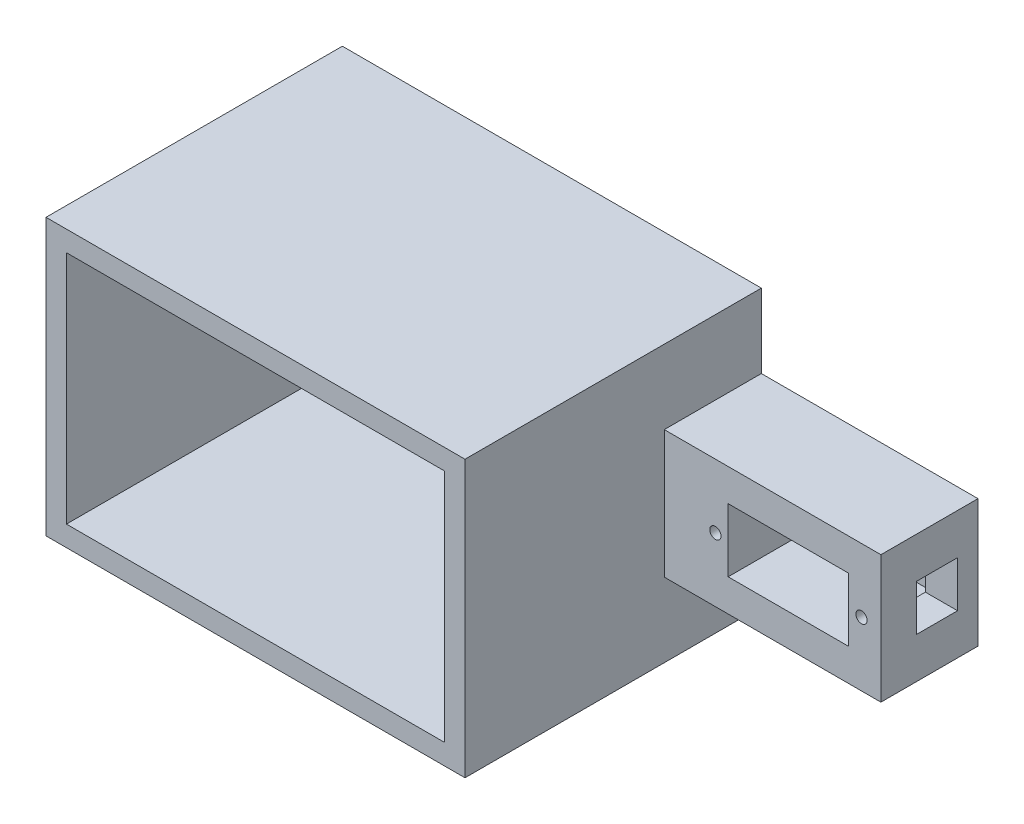
ISO-10303-21;
HEADER;
FILE_DESCRIPTION(('STEP AP214'),'2;1');
FILE_NAME('part.step','',(''),(''),'','','');
FILE_SCHEMA(('AUTOMOTIVE_DESIGN { 1 0 10303 214 1 1 1 1 }'));
ENDSEC;
DATA;
#1=APPLICATION_CONTEXT('core data for automotive mechanical design processes');
#2=APPLICATION_PROTOCOL_DEFINITION('international standard','automotive_design',2000,#1);
#3=PRODUCT_CONTEXT('',#1,'mechanical');
#4=PRODUCT('Part','Part','',(#3));
#5=PRODUCT_RELATED_PRODUCT_CATEGORY('part','',(#4));
#6=PRODUCT_DEFINITION_FORMATION('','',#4);
#7=PRODUCT_DEFINITION_CONTEXT('part definition',#1,'design');
#8=PRODUCT_DEFINITION('design','',#6,#7);
#9=PRODUCT_DEFINITION_SHAPE('','',#8);
#10=(LENGTH_UNIT() NAMED_UNIT(*) SI_UNIT(.MILLI.,.METRE.));
#11=(NAMED_UNIT(*) PLANE_ANGLE_UNIT() SI_UNIT($,.RADIAN.));
#12=(NAMED_UNIT(*) SI_UNIT($,.STERADIAN.) SOLID_ANGLE_UNIT());
#13=UNCERTAINTY_MEASURE_WITH_UNIT(LENGTH_MEASURE(1.E-05),#10,'distance_accuracy_value','');
#14=(GEOMETRIC_REPRESENTATION_CONTEXT(3) GLOBAL_UNCERTAINTY_ASSIGNED_CONTEXT((#13)) GLOBAL_UNIT_ASSIGNED_CONTEXT((#10,
#11,#12)) REPRESENTATION_CONTEXT('',''));
#15=CARTESIAN_POINT('',(0.,0.,0.));
#16=DIRECTION('',(0.,0.,1.));
#17=DIRECTION('',(1.,0.,0.));
#18=AXIS2_PLACEMENT_3D('',#15,#16,#17);
#19=CARTESIAN_POINT('',(-66.4289916908456,0.,0.));
#20=DIRECTION('',(-1.,0.,0.));
#21=DIRECTION('',(0.,0.,1.));
#22=AXIS2_PLACEMENT_3D('',#19,#20,#21);
#23=PLANE('',#22);
#24=DIRECTION('',(0.,-1.,0.));
#25=VECTOR('',#24,1.);
#26=CARTESIAN_POINT('',(-66.4289916908456,22.3868441033553,3.99999999999984));
#27=LINE('',#26,#25);
#28=CARTESIAN_POINT('',(-66.4289916908456,18.3868441033553,3.99999999999984));
#29=VERTEX_POINT('',#28);
#30=CARTESIAN_POINT('',(-66.4289916908456,-27.6131558966447,3.99999999999985));
#31=VERTEX_POINT('',#30);
#32=EDGE_CURVE('E210',#29,#31,#27,.T.);
#33=ORIENTED_EDGE('',*,*,#32,.T.);
#34=DIRECTION('',(0.,0.,-1.));
#35=VECTOR('',#34,1.);
#36=CARTESIAN_POINT('',(-66.4289916908456,-27.6131558966447,57.9999999999998));
#37=LINE('',#36,#35);
#38=CARTESIAN_POINT('',(-66.4289916908456,-27.6131558966447,58.));
#39=VERTEX_POINT('',#38);
#40=EDGE_CURVE('E60',#39,#31,#37,.T.);
#41=ORIENTED_EDGE('',*,*,#40,.F.);
#42=DIRECTION('',(0.,1.,0.));
#43=VECTOR('',#42,1.);
#44=CARTESIAN_POINT('',(-66.4289916908456,-31.6131558966447,58.));
#45=LINE('',#44,#43);
#46=CARTESIAN_POINT('',(-66.4289916908456,18.3868441033553,58.));
#47=VERTEX_POINT('',#46);
#48=EDGE_CURVE('E195',#39,#47,#45,.T.);
#49=ORIENTED_EDGE('',*,*,#48,.T.);
#50=DIRECTION('',(0.,0.,-1.));
#51=VECTOR('',#50,1.);
#52=CARTESIAN_POINT('',(-66.4289916908456,18.3868441033553,57.9999999999998));
#53=LINE('',#52,#51);
#54=EDGE_CURVE('E206',#47,#29,#53,.T.);
#55=ORIENTED_EDGE('',*,*,#54,.T.);
#56=EDGE_LOOP('',(#33,#41,#49,#55));
#57=FACE_BOUND('',#56,.T.);
#58=ADVANCED_FACE('F37',(#57),#23,.T.);
#59=CARTESIAN_POINT('',(-144.428991690846,22.3868441033553,3.99999999999984));
#60=DIRECTION('',(0.,0.,1.));
#61=DIRECTION('',(0.,-1.,0.));
#62=AXIS2_PLACEMENT_3D('',#59,#60,#61);
#63=PLANE('',#62);
#64=DIRECTION('',(0.,-1.,0.));
#65=VECTOR('',#64,1.);
#66=CARTESIAN_POINT('',(-140.428991690846,18.3868441033553,3.99999999999984));
#67=LINE('',#66,#65);
#68=CARTESIAN_POINT('',(-140.428991690846,18.3868441033553,3.99999999999984));
#69=VERTEX_POINT('',#68);
#70=CARTESIAN_POINT('',(-140.428991690846,-27.6131558966447,3.99999999999984));
#71=VERTEX_POINT('',#70);
#72=EDGE_CURVE('E186',#69,#71,#67,.T.);
#73=ORIENTED_EDGE('',*,*,#72,.T.);
#74=DIRECTION('',(-1.,0.,0.));
#75=VECTOR('',#74,1.);
#76=CARTESIAN_POINT('',(-66.4289916908456,-27.6131558966447,3.99999999999984));
#77=LINE('',#76,#75);
#78=EDGE_CURVE('E53',#31,#71,#77,.T.);
#79=ORIENTED_EDGE('',*,*,#78,.F.);
#80=ORIENTED_EDGE('',*,*,#32,.F.);
#81=DIRECTION('',(1.,0.,0.));
#82=VECTOR('',#81,1.);
#83=CARTESIAN_POINT('',(-144.428991690846,18.3868441033553,3.99999999999984));
#84=LINE('',#83,#82);
#85=EDGE_CURVE('E197',#69,#29,#84,.T.);
#86=ORIENTED_EDGE('',*,*,#85,.F.);
#87=EDGE_LOOP('',(#73,#79,#80,#86));
#88=FACE_BOUND('',#87,.T.);
#89=ADVANCED_FACE('F375',(#88),#63,.T.);
#90=CARTESIAN_POINT('',(-65.0289916908456,-17.09643110089,19.));
#91=DIRECTION('',(0.,1.,0.));
#92=DIRECTION('',(0.,0.,1.));
#93=AXIS2_PLACEMENT_3D('',#90,#91,#92);
#94=PLANE('',#93);
#95=DIRECTION('',(1.,0.,0.));
#96=VECTOR('',#95,1.);
#97=CARTESIAN_POINT('',(-65.0289916908456,-17.09643110089,19.));
#98=LINE('',#97,#96);
#99=CARTESIAN_POINT('',(-62.4289916908456,-17.09643110089,19.));
#100=VERTEX_POINT('',#99);
#101=CARTESIAN_POINT('',(-20.0289916908456,-17.09643110089,19.));
#102=VERTEX_POINT('',#101);
#103=EDGE_CURVE('E314',#100,#102,#98,.T.);
#104=ORIENTED_EDGE('',*,*,#103,.F.);
#105=DIRECTION('',(0.,0.,-1.));
#106=VECTOR('',#105,1.);
#107=CARTESIAN_POINT('',(-62.4289916908456,-17.09643110089,19.));
#108=LINE('',#107,#106);
#109=CARTESIAN_POINT('',(-62.4289916908456,-17.09643110089,0.));
#110=VERTEX_POINT('',#109);
#111=EDGE_CURVE('E246',#100,#110,#108,.T.);
#112=ORIENTED_EDGE('',*,*,#111,.T.);
#113=DIRECTION('',(1.,0.,0.));
#114=VECTOR('',#113,1.);
#115=CARTESIAN_POINT('',(-65.0289916908456,-17.09643110089,0.));
#116=LINE('',#115,#114);
#117=CARTESIAN_POINT('',(-20.0289916908456,-17.09643110089,0.));
#118=VERTEX_POINT('',#117);
#119=EDGE_CURVE('E307',#110,#118,#116,.T.);
#120=ORIENTED_EDGE('',*,*,#119,.T.);
#121=DIRECTION('',(0.,0.,-1.));
#122=VECTOR('',#121,1.);
#123=CARTESIAN_POINT('',(-20.0289916908456,-17.09643110089,19.));
#124=LINE('',#123,#122);
#125=EDGE_CURVE('E330',#102,#118,#124,.T.);
#126=ORIENTED_EDGE('',*,*,#125,.F.);
#127=EDGE_LOOP('',(#104,#112,#120,#126));
#128=FACE_BOUND('',#127,.T.);
#129=ADVANCED_FACE('F39',(#128),#94,.F.);
#130=CARTESIAN_POINT('',(-20.0289916908456,7.90356889910998,19.));
#131=DIRECTION('',(1.,0.,0.));
#132=DIRECTION('',(0.,0.,-1.));
#133=AXIS2_PLACEMENT_3D('',#130,#131,#132);
#134=PLANE('',#133);
#135=DIRECTION('',(0.,-1.,0.));
#136=VECTOR('',#135,1.);
#137=CARTESIAN_POINT('',(-20.0289916908456,-0.0964311008900161,12.));
#138=LINE('',#137,#136);
#139=CARTESIAN_POINT('',(-20.0289916908456,-0.0964311008900161,12.));
#140=VERTEX_POINT('',#139);
#141=CARTESIAN_POINT('',(-20.0289916908456,-9.09643110089002,12.));
#142=VERTEX_POINT('',#141);
#143=EDGE_CURVE('E261',#140,#142,#138,.T.);
#144=ORIENTED_EDGE('',*,*,#143,.F.);
#145=DIRECTION('',(0.,0.,1.));
#146=VECTOR('',#145,1.);
#147=CARTESIAN_POINT('',(-20.0289916908456,-0.0964311008900161,12.));
#148=LINE('',#147,#146);
#149=CARTESIAN_POINT('',(-20.0289916908456,-0.0964311008900161,4.));
#150=VERTEX_POINT('',#149);
#151=EDGE_CURVE('E269',#150,#140,#148,.T.);
#152=ORIENTED_EDGE('',*,*,#151,.F.);
#153=DIRECTION('',(0.,1.,0.));
#154=VECTOR('',#153,1.);
#155=CARTESIAN_POINT('',(-20.0289916908456,-0.0964311008900161,4.));
#156=LINE('',#155,#154);
#157=CARTESIAN_POINT('',(-20.0289916908456,-9.09643110089002,4.));
#158=VERTEX_POINT('',#157);
#159=EDGE_CURVE('E266',#158,#150,#156,.T.);
#160=ORIENTED_EDGE('',*,*,#159,.F.);
#161=DIRECTION('',(0.,0.,-1.));
#162=VECTOR('',#161,1.);
#163=CARTESIAN_POINT('',(-20.0289916908456,-9.09643110089002,12.));
#164=LINE('',#163,#162);
#165=EDGE_CURVE('E263',#142,#158,#164,.T.);
#166=ORIENTED_EDGE('',*,*,#165,.F.);
#167=EDGE_LOOP('',(#144,#152,#160,#166));
#168=FACE_BOUND('',#167,.T.);
#169=DIRECTION('',(0.,-1.,0.));
#170=VECTOR('',#169,1.);
#171=CARTESIAN_POINT('',(-20.0289916908456,7.90356889910998,0.));
#172=LINE('',#171,#170);
#173=CARTESIAN_POINT('',(-20.0289916908456,7.90356889910998,0.));
#174=VERTEX_POINT('',#173);
#175=EDGE_CURVE('E324',#174,#118,#172,.T.);
#176=ORIENTED_EDGE('',*,*,#175,.F.);
#177=DIRECTION('',(0.,0.,-1.));
#178=VECTOR('',#177,1.);
#179=CARTESIAN_POINT('',(-20.0289916908456,7.90356889910998,19.));
#180=LINE('',#179,#178);
#181=CARTESIAN_POINT('',(-20.0289916908456,7.90356889910998,19.));
#182=VERTEX_POINT('',#181);
#183=EDGE_CURVE('E322',#182,#174,#180,.T.);
#184=ORIENTED_EDGE('',*,*,#183,.F.);
#185=DIRECTION('',(0.,-1.,0.));
#186=VECTOR('',#185,1.);
#187=CARTESIAN_POINT('',(-20.0289916908456,7.90356889910998,19.));
#188=LINE('',#187,#186);
#189=EDGE_CURVE('E316',#182,#102,#188,.T.);
#190=ORIENTED_EDGE('',*,*,#189,.T.);
#191=ORIENTED_EDGE('',*,*,#125,.T.);
#192=EDGE_LOOP('',(#176,#184,#190,#191));
#193=FACE_BOUND('',#192,.T.);
#194=ADVANCED_FACE('F355',(#168,#193),#134,.T.);
#195=CARTESIAN_POINT('',(-65.0289916908456,7.90356889910998,19.));
#196=DIRECTION('',(0.,1.,0.));
#197=DIRECTION('',(0.,0.,1.));
#198=AXIS2_PLACEMENT_3D('',#195,#196,#197);
#199=PLANE('',#198);
#200=DIRECTION('',(0.,0.,-1.));
#201=VECTOR('',#200,1.);
#202=CARTESIAN_POINT('',(-62.4289916908456,7.90356889910998,19.));
#203=LINE('',#202,#201);
#204=CARTESIAN_POINT('',(-62.4289916908456,7.90356889910998,19.));
#205=VERTEX_POINT('',#204);
#206=CARTESIAN_POINT('',(-62.4289916908456,7.90356889910999,-1.61410598428779E-13));
#207=VERTEX_POINT('',#206);
#208=EDGE_CURVE('E243',#205,#207,#203,.T.);
#209=ORIENTED_EDGE('',*,*,#208,.F.);
#210=DIRECTION('',(1.,0.,0.));
#211=VECTOR('',#210,1.);
#212=CARTESIAN_POINT('',(-65.0289916908456,7.90356889910998,19.));
#213=LINE('',#212,#211);
#214=EDGE_CURVE('E320',#205,#182,#213,.T.);
#215=ORIENTED_EDGE('',*,*,#214,.T.);
#216=ORIENTED_EDGE('',*,*,#183,.T.);
#217=DIRECTION('',(1.,0.,0.));
#218=VECTOR('',#217,1.);
#219=CARTESIAN_POINT('',(-65.0289916908456,7.90356889910998,0.));
#220=LINE('',#219,#218);
#221=EDGE_CURVE('E317',#207,#174,#220,.T.);
#222=ORIENTED_EDGE('',*,*,#221,.F.);
#223=EDGE_LOOP('',(#209,#215,#216,#222));
#224=FACE_BOUND('',#223,.T.);
#225=ADVANCED_FACE('F427',(#224),#199,.T.);
#226=CARTESIAN_POINT('',(0.,0.,19.));
#227=DIRECTION('',(0.,0.,-1.));
#228=DIRECTION('',(-1.,0.,0.));
#229=AXIS2_PLACEMENT_3D('',#226,#227,#228);
#230=PLANE('',#229);
#231=CARTESIAN_POINT('',(-52.4289916908457,-4.59643110089002,19.));
#232=DIRECTION('',(0.,0.,1.));
#233=DIRECTION('',(1.,0.,0.));
#234=AXIS2_PLACEMENT_3D('',#231,#232,#233);
#235=CIRCLE('',#234,1.1);
#236=CARTESIAN_POINT('',(-51.3289916908457,-4.59643110089002,19.));
#237=VERTEX_POINT('',#236);
#238=EDGE_CURVE('E256',#237,#237,#235,.T.);
#239=ORIENTED_EDGE('',*,*,#238,.F.);
#240=EDGE_LOOP('',(#239));
#241=FACE_BOUND('',#240,.T.);
#242=CARTESIAN_POINT('',(-23.8289916908456,-4.59643110089002,19.));
#243=DIRECTION('',(0.,0.,1.));
#244=DIRECTION('',(1.,0.,0.));
#245=AXIS2_PLACEMENT_3D('',#242,#243,#244);
#246=CIRCLE('',#245,1.1);
#247=CARTESIAN_POINT('',(-22.7289916908456,-4.59643110089002,19.));
#248=VERTEX_POINT('',#247);
#249=EDGE_CURVE('E252',#248,#248,#246,.T.);
#250=ORIENTED_EDGE('',*,*,#249,.F.);
#251=EDGE_LOOP('',(#250));
#252=FACE_BOUND('',#251,.T.);
#253=DIRECTION('',(1.,0.,0.));
#254=VECTOR('',#253,1.);
#255=CARTESIAN_POINT('',(-49.9289916908456,-10.79643110089,19.));
#256=LINE('',#255,#254);
#257=CARTESIAN_POINT('',(-49.9289916908456,-10.79643110089,19.));
#258=VERTEX_POINT('',#257);
#259=CARTESIAN_POINT('',(-26.3289916908456,-10.79643110089,19.));
#260=VERTEX_POINT('',#259);
#261=EDGE_CURVE('E297',#258,#260,#256,.T.);
#262=ORIENTED_EDGE('',*,*,#261,.F.);
#263=DIRECTION('',(0.,-1.,0.));
#264=VECTOR('',#263,1.);
#265=CARTESIAN_POINT('',(-49.9289916908456,1.60356889910999,19.));
#266=LINE('',#265,#264);
#267=CARTESIAN_POINT('',(-49.9289916908456,1.60356889910999,19.));
#268=VERTEX_POINT('',#267);
#269=EDGE_CURVE('E275',#268,#258,#266,.T.);
#270=ORIENTED_EDGE('',*,*,#269,.F.);
#271=DIRECTION('',(-1.,0.,0.));
#272=VECTOR('',#271,1.);
#273=CARTESIAN_POINT('',(-49.9289916908456,1.60356889910999,19.));
#274=LINE('',#273,#272);
#275=CARTESIAN_POINT('',(-26.3289916908456,1.60356889910999,19.));
#276=VERTEX_POINT('',#275);
#277=EDGE_CURVE('E286',#276,#268,#274,.T.);
#278=ORIENTED_EDGE('',*,*,#277,.F.);
#279=DIRECTION('',(0.,1.,0.));
#280=VECTOR('',#279,1.);
#281=CARTESIAN_POINT('',(-26.3289916908456,1.60356889910999,19.));
#282=LINE('',#281,#280);
#283=EDGE_CURVE('E300',#260,#276,#282,.T.);
#284=ORIENTED_EDGE('',*,*,#283,.F.);
#285=EDGE_LOOP('',(#262,#270,#278,#284));
#286=FACE_BOUND('',#285,.T.);
#287=ORIENTED_EDGE('',*,*,#214,.F.);
#288=DIRECTION('',(0.,-1.,0.));
#289=VECTOR('',#288,1.);
#290=CARTESIAN_POINT('',(-62.4289916908456,7.90356889910998,19.));
#291=LINE('',#290,#289);
#292=EDGE_CURVE('E249',#205,#100,#291,.T.);
#293=ORIENTED_EDGE('',*,*,#292,.T.);
#294=ORIENTED_EDGE('',*,*,#103,.T.);
#295=ORIENTED_EDGE('',*,*,#189,.F.);
#296=EDGE_LOOP('',(#287,#293,#294,#295));
#297=FACE_BOUND('',#296,.T.);
#298=ADVANCED_FACE('F424',(#241,#252,#286,#297),#230,.F.);
#299=CARTESIAN_POINT('',(0.,0.,0.));
#300=DIRECTION('',(0.,0.,-1.));
#301=DIRECTION('',(-1.,0.,0.));
#302=AXIS2_PLACEMENT_3D('',#299,#300,#301);
#303=PLANE('',#302);
#304=DIRECTION('',(1.,0.,0.));
#305=VECTOR('',#304,1.);
#306=CARTESIAN_POINT('',(-66.4289916908456,22.3868441033553,-1.61410598428779E-13));
#307=LINE('',#306,#305);
#308=CARTESIAN_POINT('',(-144.428991690846,22.3868441033553,-1.61410598428779E-13));
#309=VERTEX_POINT('',#308);
#310=CARTESIAN_POINT('',(-62.4289916908456,22.3868441033553,-1.61410598428779E-13));
#311=VERTEX_POINT('',#310);
#312=EDGE_CURVE('E233',#309,#311,#307,.T.);
#313=ORIENTED_EDGE('',*,*,#312,.T.);
#314=DIRECTION('',(0.,1.,0.));
#315=VECTOR('',#314,1.);
#316=CARTESIAN_POINT('',(-62.4289916908456,-34.6131558966447,-1.61410598428779E-13));
#317=LINE('',#316,#315);
#318=EDGE_CURVE('E240',#207,#311,#317,.T.);
#319=ORIENTED_EDGE('',*,*,#318,.F.);
#320=ORIENTED_EDGE('',*,*,#221,.T.);
#321=ORIENTED_EDGE('',*,*,#175,.T.);
#322=ORIENTED_EDGE('',*,*,#119,.F.);
#323=CARTESIAN_POINT('',(-62.4289916908456,-31.6131558966447,-1.61410598428779E-13));
#324=VERTEX_POINT('',#323);
#325=EDGE_CURVE('E241',#324,#110,#317,.T.);
#326=ORIENTED_EDGE('',*,*,#325,.F.);
#327=DIRECTION('',(1.,0.,0.));
#328=VECTOR('',#327,1.);
#329=CARTESIAN_POINT('',(-66.4289916908456,-31.6131558966447,-1.61410598428779E-13));
#330=LINE('',#329,#328);
#331=CARTESIAN_POINT('',(-144.428991690846,-31.6131558966447,-1.61410598428779E-13));
#332=VERTEX_POINT('',#331);
#333=EDGE_CURVE('E238',#332,#324,#330,.T.);
#334=ORIENTED_EDGE('',*,*,#333,.F.);
#335=DIRECTION('',(0.,-1.,0.));
#336=VECTOR('',#335,1.);
#337=CARTESIAN_POINT('',(-144.428991690846,22.3868441033553,-1.61410598428779E-13));
#338=LINE('',#337,#336);
#339=EDGE_CURVE('E217',#309,#332,#338,.T.);
#340=ORIENTED_EDGE('',*,*,#339,.F.);
#341=EDGE_LOOP('',(#313,#319,#320,#321,#322,#326,#334,#340));
#342=FACE_BOUND('',#341,.T.);
#343=ADVANCED_FACE('F422',(#342),#303,.T.);
#344=CARTESIAN_POINT('',(-49.9289916908456,1.60356889910999,1.5));
#345=DIRECTION('',(-1.,0.,0.));
#346=DIRECTION('',(0.,0.,1.));
#347=AXIS2_PLACEMENT_3D('',#344,#345,#346);
#348=PLANE('',#347);
#349=ORIENTED_EDGE('',*,*,#269,.T.);
#350=DIRECTION('',(0.,0.,1.));
#351=VECTOR('',#350,1.);
#352=CARTESIAN_POINT('',(-49.9289916908456,-10.79643110089,1.5));
#353=LINE('',#352,#351);
#354=CARTESIAN_POINT('',(-49.9289916908456,-10.79643110089,1.5));
#355=VERTEX_POINT('',#354);
#356=EDGE_CURVE('E295',#355,#258,#353,.T.);
#357=ORIENTED_EDGE('',*,*,#356,.F.);
#358=DIRECTION('',(0.,-1.,0.));
#359=VECTOR('',#358,1.);
#360=CARTESIAN_POINT('',(-49.9289916908456,1.60356889910999,1.5));
#361=LINE('',#360,#359);
#362=CARTESIAN_POINT('',(-49.9289916908456,1.60356889910999,1.5));
#363=VERTEX_POINT('',#362);
#364=EDGE_CURVE('E282',#363,#355,#361,.T.);
#365=ORIENTED_EDGE('',*,*,#364,.F.);
#366=DIRECTION('',(0.,0.,1.));
#367=VECTOR('',#366,1.);
#368=CARTESIAN_POINT('',(-49.9289916908456,1.60356889910999,1.5));
#369=LINE('',#368,#367);
#370=EDGE_CURVE('E305',#363,#268,#369,.T.);
#371=ORIENTED_EDGE('',*,*,#370,.T.);
#372=EDGE_LOOP('',(#349,#357,#365,#371));
#373=FACE_BOUND('',#372,.T.);
#374=ADVANCED_FACE('F413',(#373),#348,.F.);
#375=CARTESIAN_POINT('',(-49.9289916908456,1.60356889910999,1.5));
#376=DIRECTION('',(0.,1.,0.));
#377=DIRECTION('',(0.,0.,1.));
#378=AXIS2_PLACEMENT_3D('',#375,#376,#377);
#379=PLANE('',#378);
#380=ORIENTED_EDGE('',*,*,#277,.T.);
#381=ORIENTED_EDGE('',*,*,#370,.F.);
#382=DIRECTION('',(-1.,0.,0.));
#383=VECTOR('',#382,1.);
#384=CARTESIAN_POINT('',(-49.9289916908456,1.60356889910999,1.5));
#385=LINE('',#384,#383);
#386=CARTESIAN_POINT('',(-26.3289916908456,1.60356889910999,1.5));
#387=VERTEX_POINT('',#386);
#388=EDGE_CURVE('E292',#387,#363,#385,.T.);
#389=ORIENTED_EDGE('',*,*,#388,.F.);
#390=DIRECTION('',(0.,0.,1.));
#391=VECTOR('',#390,1.);
#392=CARTESIAN_POINT('',(-26.3289916908456,1.60356889910999,1.5));
#393=LINE('',#392,#391);
#394=EDGE_CURVE('E308',#387,#276,#393,.T.);
#395=ORIENTED_EDGE('',*,*,#394,.T.);
#396=EDGE_LOOP('',(#380,#381,#389,#395));
#397=FACE_BOUND('',#396,.T.);
#398=ADVANCED_FACE('F410',(#397),#379,.F.);
#399=CARTESIAN_POINT('',(-26.3289916908456,1.60356889910999,1.5));
#400=DIRECTION('',(1.,0.,0.));
#401=DIRECTION('',(0.,0.,-1.));
#402=AXIS2_PLACEMENT_3D('',#399,#400,#401);
#403=PLANE('',#402);
#404=DIRECTION('',(0.,0.,1.));
#405=VECTOR('',#404,1.);
#406=CARTESIAN_POINT('',(-26.3289916908456,-0.0964311008900161,1.5));
#407=LINE('',#406,#405);
#408=CARTESIAN_POINT('',(-26.3289916908456,-0.0964311008900161,4.));
#409=VERTEX_POINT('',#408);
#410=CARTESIAN_POINT('',(-26.3289916908456,-0.0964311008900161,12.));
#411=VERTEX_POINT('',#410);
#412=EDGE_CURVE('E46',#409,#411,#407,.T.);
#413=ORIENTED_EDGE('',*,*,#412,.T.);
#414=DIRECTION('',(0.,-1.,0.));
#415=VECTOR('',#414,1.);
#416=CARTESIAN_POINT('',(-26.3289916908456,1.60356889910998,12.));
#417=LINE('',#416,#415);
#418=CARTESIAN_POINT('',(-26.3289916908456,-9.09643110089002,12.));
#419=VERTEX_POINT('',#418);
#420=EDGE_CURVE('E11',#411,#419,#417,.T.);
#421=ORIENTED_EDGE('',*,*,#420,.T.);
#422=DIRECTION('',(0.,0.,-1.));
#423=VECTOR('',#422,1.);
#424=CARTESIAN_POINT('',(-26.3289916908456,-9.09643110089002,1.5));
#425=LINE('',#424,#423);
#426=CARTESIAN_POINT('',(-26.3289916908456,-9.09643110089002,4.));
#427=VERTEX_POINT('',#426);
#428=EDGE_CURVE('E333',#419,#427,#425,.T.);
#429=ORIENTED_EDGE('',*,*,#428,.T.);
#430=DIRECTION('',(0.,1.,0.));
#431=VECTOR('',#430,1.);
#432=CARTESIAN_POINT('',(-26.3289916908456,1.60356889910998,4.));
#433=LINE('',#432,#431);
#434=EDGE_CURVE('E336',#427,#409,#433,.T.);
#435=ORIENTED_EDGE('',*,*,#434,.T.);
#436=EDGE_LOOP('',(#413,#421,#429,#435));
#437=FACE_BOUND('',#436,.T.);
#438=ORIENTED_EDGE('',*,*,#283,.T.);
#439=ORIENTED_EDGE('',*,*,#394,.F.);
#440=DIRECTION('',(0.,1.,0.));
#441=VECTOR('',#440,1.);
#442=CARTESIAN_POINT('',(-26.3289916908456,1.60356889910999,1.5));
#443=LINE('',#442,#441);
#444=CARTESIAN_POINT('',(-26.3289916908456,-10.79643110089,1.5));
#445=VERTEX_POINT('',#444);
#446=EDGE_CURVE('E289',#445,#387,#443,.T.);
#447=ORIENTED_EDGE('',*,*,#446,.F.);
#448=DIRECTION('',(0.,0.,1.));
#449=VECTOR('',#448,1.);
#450=CARTESIAN_POINT('',(-26.3289916908456,-10.79643110089,1.5));
#451=LINE('',#450,#449);
#452=EDGE_CURVE('E310',#445,#260,#451,.T.);
#453=ORIENTED_EDGE('',*,*,#452,.T.);
#454=EDGE_LOOP('',(#438,#439,#447,#453));
#455=FACE_BOUND('',#454,.T.);
#456=ADVANCED_FACE('F341',(#437,#455),#403,.F.);
#457=CARTESIAN_POINT('',(-49.9289916908456,-10.79643110089,1.5));
#458=DIRECTION('',(0.,-1.,0.));
#459=DIRECTION('',(1.,0.,0.));
#460=AXIS2_PLACEMENT_3D('',#457,#458,#459);
#461=PLANE('',#460);
#462=ORIENTED_EDGE('',*,*,#261,.T.);
#463=ORIENTED_EDGE('',*,*,#452,.F.);
#464=DIRECTION('',(1.,0.,0.));
#465=VECTOR('',#464,1.);
#466=CARTESIAN_POINT('',(-49.9289916908456,-10.79643110089,1.5));
#467=LINE('',#466,#465);
#468=EDGE_CURVE('E285',#355,#445,#467,.T.);
#469=ORIENTED_EDGE('',*,*,#468,.F.);
#470=ORIENTED_EDGE('',*,*,#356,.T.);
#471=EDGE_LOOP('',(#462,#463,#469,#470));
#472=FACE_BOUND('',#471,.T.);
#473=ADVANCED_FACE('F405',(#472),#461,.F.);
#474=CARTESIAN_POINT('',(0.,0.,1.5));
#475=DIRECTION('',(0.,0.,1.));
#476=DIRECTION('',(1.,0.,0.));
#477=AXIS2_PLACEMENT_3D('',#474,#475,#476);
#478=PLANE('',#477);
#479=ORIENTED_EDGE('',*,*,#364,.T.);
#480=ORIENTED_EDGE('',*,*,#468,.T.);
#481=ORIENTED_EDGE('',*,*,#446,.T.);
#482=ORIENTED_EDGE('',*,*,#388,.T.);
#483=EDGE_LOOP('',(#479,#480,#481,#482));
#484=FACE_BOUND('',#483,.T.);
#485=ADVANCED_FACE('F400',(#484),#478,.T.);
#486=CARTESIAN_POINT('',(-27.0289916908456,-0.0964311008900161,12.));
#487=DIRECTION('',(0.,0.,1.));
#488=DIRECTION('',(0.,-1.,0.));
#489=AXIS2_PLACEMENT_3D('',#486,#487,#488);
#490=PLANE('',#489);
#491=CARTESIAN_POINT('',(-23.8289916908456,-4.59643110089002,12.));
#492=DIRECTION('',(0.,0.,1.));
#493=DIRECTION('',(0.,-1.,0.));
#494=AXIS2_PLACEMENT_3D('',#491,#492,#493);
#495=CIRCLE('',#494,1.1);
#496=CARTESIAN_POINT('',(-23.8289916908456,-5.69643110089002,12.));
#497=VERTEX_POINT('',#496);
#498=EDGE_CURVE('E41',#497,#497,#495,.T.);
#499=ORIENTED_EDGE('',*,*,#498,.T.);
#500=EDGE_LOOP('',(#499));
#501=FACE_BOUND('',#500,.T.);
#502=DIRECTION('',(1.,0.,0.));
#503=VECTOR('',#502,1.);
#504=CARTESIAN_POINT('',(-27.0289916908456,-0.0964311008900161,12.));
#505=LINE('',#504,#503);
#506=EDGE_CURVE('E273',#411,#140,#505,.T.);
#507=ORIENTED_EDGE('',*,*,#506,.T.);
#508=ORIENTED_EDGE('',*,*,#143,.T.);
#509=DIRECTION('',(1.,0.,0.));
#510=VECTOR('',#509,1.);
#511=CARTESIAN_POINT('',(-27.0289916908456,-9.09643110089002,12.));
#512=LINE('',#511,#510);
#513=EDGE_CURVE('E272',#419,#142,#512,.T.);
#514=ORIENTED_EDGE('',*,*,#513,.F.);
#515=ORIENTED_EDGE('',*,*,#420,.F.);
#516=EDGE_LOOP('',(#507,#508,#514,#515));
#517=FACE_BOUND('',#516,.T.);
#518=ADVANCED_FACE('F359',(#501,#517),#490,.F.);
#519=CARTESIAN_POINT('',(-27.0289916908456,-0.0964311008900161,12.));
#520=DIRECTION('',(0.,1.,0.));
#521=DIRECTION('',(0.,0.,1.));
#522=AXIS2_PLACEMENT_3D('',#519,#520,#521);
#523=PLANE('',#522);
#524=DIRECTION('',(1.,0.,0.));
#525=VECTOR('',#524,1.);
#526=CARTESIAN_POINT('',(-27.0289916908456,-0.0964311008900161,4.));
#527=LINE('',#526,#525);
#528=EDGE_CURVE('E276',#409,#150,#527,.T.);
#529=ORIENTED_EDGE('',*,*,#528,.T.);
#530=ORIENTED_EDGE('',*,*,#151,.T.);
#531=ORIENTED_EDGE('',*,*,#506,.F.);
#532=ORIENTED_EDGE('',*,*,#412,.F.);
#533=EDGE_LOOP('',(#529,#530,#531,#532));
#534=FACE_BOUND('',#533,.T.);
#535=ADVANCED_FACE('F347',(#534),#523,.F.);
#536=CARTESIAN_POINT('',(-27.0289916908456,-0.0964311008900161,4.));
#537=DIRECTION('',(0.,0.,-1.));
#538=DIRECTION('',(0.,1.,0.));
#539=AXIS2_PLACEMENT_3D('',#536,#537,#538);
#540=PLANE('',#539);
#541=DIRECTION('',(1.,0.,0.));
#542=VECTOR('',#541,1.);
#543=CARTESIAN_POINT('',(-27.0289916908456,-9.09643110089002,4.));
#544=LINE('',#543,#542);
#545=EDGE_CURVE('E278',#427,#158,#544,.T.);
#546=ORIENTED_EDGE('',*,*,#545,.T.);
#547=ORIENTED_EDGE('',*,*,#159,.T.);
#548=ORIENTED_EDGE('',*,*,#528,.F.);
#549=ORIENTED_EDGE('',*,*,#434,.F.);
#550=EDGE_LOOP('',(#546,#547,#548,#549));
#551=FACE_BOUND('',#550,.T.);
#552=ADVANCED_FACE('F349',(#551),#540,.F.);
#553=CARTESIAN_POINT('',(-27.0289916908456,-9.09643110089002,12.));
#554=DIRECTION('',(0.,-1.,0.));
#555=DIRECTION('',(0.,0.,-1.));
#556=AXIS2_PLACEMENT_3D('',#553,#554,#555);
#557=PLANE('',#556);
#558=ORIENTED_EDGE('',*,*,#513,.T.);
#559=ORIENTED_EDGE('',*,*,#165,.T.);
#560=ORIENTED_EDGE('',*,*,#545,.F.);
#561=ORIENTED_EDGE('',*,*,#428,.F.);
#562=EDGE_LOOP('',(#558,#559,#560,#561));
#563=FACE_BOUND('',#562,.T.);
#564=ADVANCED_FACE('F361',(#563),#557,.F.);
#565=CARTESIAN_POINT('',(-23.8289916908456,-4.59643110089002,11.5));
#566=DIRECTION('',(0.,0.,1.));
#567=DIRECTION('',(1.,0.,0.));
#568=AXIS2_PLACEMENT_3D('',#565,#566,#567);
#569=CYLINDRICAL_SURFACE('',#568,1.1);
#570=ORIENTED_EDGE('',*,*,#249,.T.);
#571=EDGE_LOOP('',(#570));
#572=FACE_BOUND('',#571,.T.);
#573=ORIENTED_EDGE('',*,*,#498,.F.);
#574=EDGE_LOOP('',(#573));
#575=FACE_BOUND('',#574,.T.);
#576=ADVANCED_FACE('F363',(#572,#575),#569,.F.);
#577=CARTESIAN_POINT('',(-52.4289916908457,-4.59643110089002,11.5));
#578=DIRECTION('',(0.,0.,1.));
#579=DIRECTION('',(1.,0.,0.));
#580=AXIS2_PLACEMENT_3D('',#577,#578,#579);
#581=CYLINDRICAL_SURFACE('',#580,1.1);
#582=CARTESIAN_POINT('',(-52.4289916908457,-4.59643110089002,11.5));
#583=DIRECTION('',(0.,0.,1.));
#584=DIRECTION('',(1.,0.,0.));
#585=AXIS2_PLACEMENT_3D('',#582,#583,#584);
#586=CIRCLE('',#585,1.1);
#587=CARTESIAN_POINT('',(-51.3289916908457,-4.59643110089002,11.5));
#588=VERTEX_POINT('',#587);
#589=EDGE_CURVE('E253',#588,#588,#586,.T.);
#590=ORIENTED_EDGE('',*,*,#589,.F.);
#591=EDGE_LOOP('',(#590));
#592=FACE_BOUND('',#591,.T.);
#593=ORIENTED_EDGE('',*,*,#238,.T.);
#594=EDGE_LOOP('',(#593));
#595=FACE_BOUND('',#594,.T.);
#596=ADVANCED_FACE('F369',(#592,#595),#581,.F.);
#597=CARTESIAN_POINT('',(-52.4289916908457,-4.59643110089002,11.5));
#598=DIRECTION('',(0.,0.,1.));
#599=DIRECTION('',(1.,0.,0.));
#600=AXIS2_PLACEMENT_3D('',#597,#598,#599);
#601=PLANE('',#600);
#602=ORIENTED_EDGE('',*,*,#589,.T.);
#603=EDGE_LOOP('',(#602));
#604=FACE_BOUND('',#603,.T.);
#605=ADVANCED_FACE('F388',(#604),#601,.T.);
#606=CARTESIAN_POINT('',(-62.4289916908456,7.90356889910998,36.5));
#607=DIRECTION('',(1.,0.,0.));
#608=DIRECTION('',(0.,0.,-1.));
#609=AXIS2_PLACEMENT_3D('',#606,#607,#608);
#610=PLANE('',#609);
#611=DIRECTION('',(0.,0.,-1.));
#612=VECTOR('',#611,1.);
#613=CARTESIAN_POINT('',(-62.4289916908456,22.3868441033553,36.5));
#614=LINE('',#613,#612);
#615=CARTESIAN_POINT('',(-62.4289916908456,22.3868441033553,58.));
#616=VERTEX_POINT('',#615);
#617=EDGE_CURVE('E231',#616,#311,#614,.T.);
#618=ORIENTED_EDGE('',*,*,#617,.F.);
#619=DIRECTION('',(0.,1.,0.));
#620=VECTOR('',#619,1.);
#621=CARTESIAN_POINT('',(-62.4289916908456,-31.6131558966447,58.));
#622=LINE('',#621,#620);
#623=CARTESIAN_POINT('',(-62.4289916908456,-31.6131558966447,58.));
#624=VERTEX_POINT('',#623);
#625=EDGE_CURVE('E224',#624,#616,#622,.T.);
#626=ORIENTED_EDGE('',*,*,#625,.F.);
#627=DIRECTION('',(0.,0.,1.));
#628=VECTOR('',#627,1.);
#629=CARTESIAN_POINT('',(-62.4289916908456,-31.6131558966447,36.5));
#630=LINE('',#629,#628);
#631=EDGE_CURVE('E236',#324,#624,#630,.T.);
#632=ORIENTED_EDGE('',*,*,#631,.F.);
#633=ORIENTED_EDGE('',*,*,#325,.T.);
#634=ORIENTED_EDGE('',*,*,#111,.F.);
#635=ORIENTED_EDGE('',*,*,#292,.F.);
#636=ORIENTED_EDGE('',*,*,#208,.T.);
#637=ORIENTED_EDGE('',*,*,#318,.T.);
#638=EDGE_LOOP('',(#618,#626,#632,#633,#634,#635,#636,#637));
#639=FACE_BOUND('',#638,.T.);
#640=ADVANCED_FACE('F385',(#639),#610,.T.);
#641=CARTESIAN_POINT('',(-66.4289916908456,-31.6131558966447,36.5));
#642=DIRECTION('',(0.,1.,0.));
#643=DIRECTION('',(0.,0.,1.));
#644=AXIS2_PLACEMENT_3D('',#641,#642,#643);
#645=PLANE('',#644);
#646=DIRECTION('',(1.,0.,0.));
#647=VECTOR('',#646,1.);
#648=CARTESIAN_POINT('',(-66.4289916908456,-31.6131558966447,58.));
#649=LINE('',#648,#647);
#650=CARTESIAN_POINT('',(-144.428991690846,-31.6131558966447,57.9999999999998));
#651=VERTEX_POINT('',#650);
#652=EDGE_CURVE('E227',#651,#624,#649,.T.);
#653=ORIENTED_EDGE('',*,*,#652,.F.);
#654=DIRECTION('',(0.,0.,1.));
#655=VECTOR('',#654,1.);
#656=CARTESIAN_POINT('',(-144.428991690846,-31.6131558966447,-1.61410598428779E-13));
#657=LINE('',#656,#655);
#658=EDGE_CURVE('E211',#332,#651,#657,.T.);
#659=ORIENTED_EDGE('',*,*,#658,.F.);
#660=ORIENTED_EDGE('',*,*,#333,.T.);
#661=ORIENTED_EDGE('',*,*,#631,.T.);
#662=EDGE_LOOP('',(#653,#659,#660,#661));
#663=FACE_BOUND('',#662,.T.);
#664=ADVANCED_FACE('F383',(#663),#645,.F.);
#665=CARTESIAN_POINT('',(-66.4289916908456,22.3868441033553,36.5));
#666=DIRECTION('',(0.,-1.,0.));
#667=DIRECTION('',(0.,0.,-1.));
#668=AXIS2_PLACEMENT_3D('',#665,#666,#667);
#669=PLANE('',#668);
#670=ORIENTED_EDGE('',*,*,#617,.T.);
#671=ORIENTED_EDGE('',*,*,#312,.F.);
#672=DIRECTION('',(0.,0.,1.));
#673=VECTOR('',#672,1.);
#674=CARTESIAN_POINT('',(-144.428991690846,22.3868441033553,-1.61410598428779E-13));
#675=LINE('',#674,#673);
#676=CARTESIAN_POINT('',(-144.428991690846,22.3868441033553,57.9999999999998));
#677=VERTEX_POINT('',#676);
#678=EDGE_CURVE('E214',#309,#677,#675,.T.);
#679=ORIENTED_EDGE('',*,*,#678,.T.);
#680=DIRECTION('',(1.,0.,0.));
#681=VECTOR('',#680,1.);
#682=CARTESIAN_POINT('',(-66.4289916908456,22.3868441033553,58.));
#683=LINE('',#682,#681);
#684=EDGE_CURVE('E220',#677,#616,#683,.T.);
#685=ORIENTED_EDGE('',*,*,#684,.T.);
#686=EDGE_LOOP('',(#670,#671,#679,#685));
#687=FACE_BOUND('',#686,.T.);
#688=ADVANCED_FACE('F458',(#687),#669,.F.);
#689=CARTESIAN_POINT('',(0.,0.,58.));
#690=DIRECTION('',(0.,0.,1.));
#691=DIRECTION('',(1.,0.,0.));
#692=AXIS2_PLACEMENT_3D('',#689,#690,#691);
#693=PLANE('',#692);
#694=DIRECTION('',(0.,-1.,0.));
#695=VECTOR('',#694,1.);
#696=CARTESIAN_POINT('',(-140.428991690846,18.3868441033553,57.9999999999998));
#697=LINE('',#696,#695);
#698=CARTESIAN_POINT('',(-140.428991690846,18.3868441033553,57.9999999999998));
#699=VERTEX_POINT('',#698);
#700=CARTESIAN_POINT('',(-140.428991690846,-27.6131558966447,57.9999999999998));
#701=VERTEX_POINT('',#700);
#702=EDGE_CURVE('E177',#699,#701,#697,.T.);
#703=ORIENTED_EDGE('',*,*,#702,.F.);
#704=DIRECTION('',(1.,0.,0.));
#705=VECTOR('',#704,1.);
#706=CARTESIAN_POINT('',(-144.428991690846,18.3868441033553,57.9999999999998));
#707=LINE('',#706,#705);
#708=EDGE_CURVE('E202',#699,#47,#707,.T.);
#709=ORIENTED_EDGE('',*,*,#708,.T.);
#710=ORIENTED_EDGE('',*,*,#48,.F.);
#711=DIRECTION('',(-1.,0.,0.));
#712=VECTOR('',#711,1.);
#713=CARTESIAN_POINT('',(-66.4289916908456,-27.6131558966447,57.9999999999998));
#714=LINE('',#713,#712);
#715=EDGE_CURVE('E191',#39,#701,#714,.T.);
#716=ORIENTED_EDGE('',*,*,#715,.T.);
#717=EDGE_LOOP('',(#703,#709,#710,#716));
#718=FACE_BOUND('',#717,.T.);
#719=ORIENTED_EDGE('',*,*,#684,.F.);
#720=DIRECTION('',(0.,-1.,0.));
#721=VECTOR('',#720,1.);
#722=CARTESIAN_POINT('',(-144.428991690846,22.3868441033553,57.9999999999998));
#723=LINE('',#722,#721);
#724=EDGE_CURVE('E204',#677,#651,#723,.T.);
#725=ORIENTED_EDGE('',*,*,#724,.T.);
#726=ORIENTED_EDGE('',*,*,#652,.T.);
#727=ORIENTED_EDGE('',*,*,#625,.T.);
#728=EDGE_LOOP('',(#719,#725,#726,#727));
#729=FACE_BOUND('',#728,.T.);
#730=ADVANCED_FACE('F193',(#718,#729),#693,.T.);
#731=CARTESIAN_POINT('',(-144.428991690846,0.,0.));
#732=DIRECTION('',(1.,0.,0.));
#733=DIRECTION('',(0.,0.,-1.));
#734=AXIS2_PLACEMENT_3D('',#731,#732,#733);
#735=PLANE('',#734);
#736=ORIENTED_EDGE('',*,*,#658,.T.);
#737=ORIENTED_EDGE('',*,*,#724,.F.);
#738=ORIENTED_EDGE('',*,*,#678,.F.);
#739=ORIENTED_EDGE('',*,*,#339,.T.);
#740=EDGE_LOOP('',(#736,#737,#738,#739));
#741=FACE_BOUND('',#740,.T.);
#742=ADVANCED_FACE('F462',(#741),#735,.F.);
#743=CARTESIAN_POINT('',(-144.428991690846,18.3868441033553,57.9999999999998));
#744=DIRECTION('',(0.,1.,0.));
#745=DIRECTION('',(0.,0.,1.));
#746=AXIS2_PLACEMENT_3D('',#743,#744,#745);
#747=PLANE('',#746);
#748=ORIENTED_EDGE('',*,*,#708,.F.);
#749=DIRECTION('',(0.,0.,-1.));
#750=VECTOR('',#749,1.);
#751=CARTESIAN_POINT('',(-140.428991690846,18.3868441033553,57.9999999999998));
#752=LINE('',#751,#750);
#753=EDGE_CURVE('E182',#699,#69,#752,.T.);
#754=ORIENTED_EDGE('',*,*,#753,.T.);
#755=ORIENTED_EDGE('',*,*,#85,.T.);
#756=ORIENTED_EDGE('',*,*,#54,.F.);
#757=EDGE_LOOP('',(#748,#754,#755,#756));
#758=FACE_BOUND('',#757,.T.);
#759=ADVANCED_FACE('F476',(#758),#747,.F.);
#760=CARTESIAN_POINT('',(-66.4289916908456,-27.6131558966447,57.9999999999998));
#761=DIRECTION('',(0.,-1.,0.));
#762=DIRECTION('',(1.,0.,0.));
#763=AXIS2_PLACEMENT_3D('',#760,#761,#762);
#764=PLANE('',#763);
#765=ORIENTED_EDGE('',*,*,#78,.T.);
#766=DIRECTION('',(0.,0.,-1.));
#767=VECTOR('',#766,1.);
#768=CARTESIAN_POINT('',(-140.428991690846,-27.6131558966447,57.9999999999998));
#769=LINE('',#768,#767);
#770=EDGE_CURVE('E180',#701,#71,#769,.T.);
#771=ORIENTED_EDGE('',*,*,#770,.F.);
#772=ORIENTED_EDGE('',*,*,#715,.F.);
#773=ORIENTED_EDGE('',*,*,#40,.T.);
#774=EDGE_LOOP('',(#765,#771,#772,#773));
#775=FACE_BOUND('',#774,.T.);
#776=ADVANCED_FACE('F190',(#775),#764,.F.);
#777=CARTESIAN_POINT('',(-140.428991690846,18.3868441033553,57.9999999999998));
#778=DIRECTION('',(1.,0.,0.));
#779=DIRECTION('',(0.,0.,-1.));
#780=AXIS2_PLACEMENT_3D('',#777,#778,#779);
#781=PLANE('',#780);
#782=ORIENTED_EDGE('',*,*,#72,.F.);
#783=ORIENTED_EDGE('',*,*,#753,.F.);
#784=ORIENTED_EDGE('',*,*,#702,.T.);
#785=ORIENTED_EDGE('',*,*,#770,.T.);
#786=EDGE_LOOP('',(#782,#783,#784,#785));
#787=FACE_BOUND('',#786,.T.);
#788=ADVANCED_FACE('F179',(#787),#781,.T.);
#789=CLOSED_SHELL('',(#58,#89,#129,#194,#225,#298,#343,#374,#398,#456,#473,#485,#518,#535,#552,
#564,#576,#596,#605,#640,#664,#688,#730,#742,#759,#776,#788));
#790=MANIFOLD_SOLID_BREP('B2',#789);
#791=ADVANCED_BREP_SHAPE_REPRESENTATION('',(#18,#790),#14);
#792=SHAPE_DEFINITION_REPRESENTATION(#9,#791);
ENDSEC;
END-ISO-10303-21;
